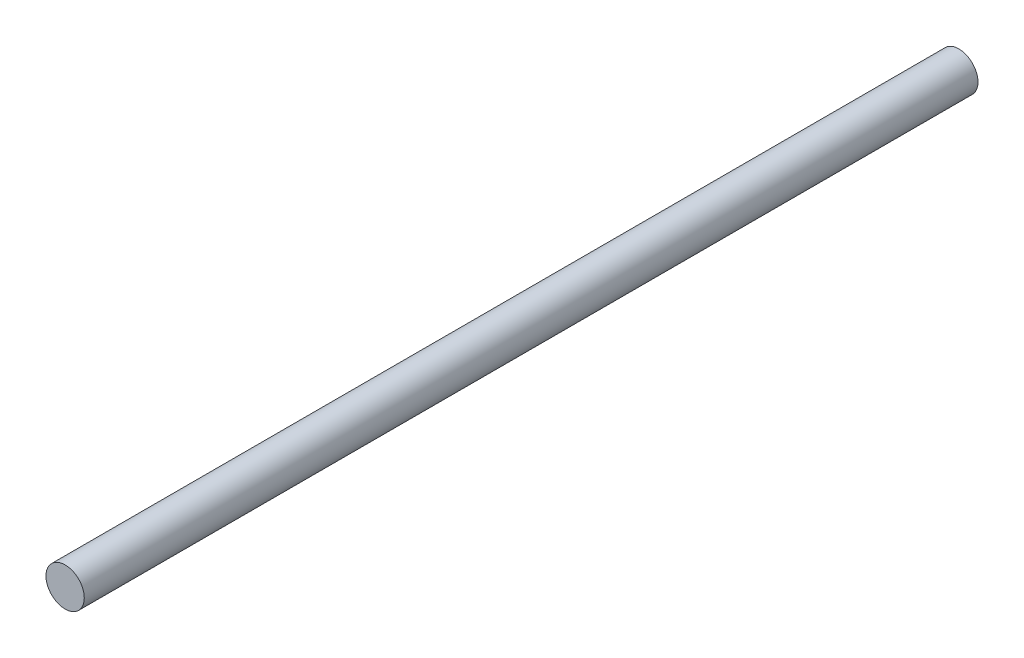
ISO-10303-21;
HEADER;
FILE_DESCRIPTION(('STEP AP214'),'2;1');
FILE_NAME('part.step','',(''),(''),'','','');
FILE_SCHEMA(('AUTOMOTIVE_DESIGN { 1 0 10303 214 1 1 1 1 }'));
ENDSEC;
DATA;
#1=APPLICATION_CONTEXT('core data for automotive mechanical design processes');
#2=APPLICATION_PROTOCOL_DEFINITION('international standard','automotive_design',2000,#1);
#3=PRODUCT_CONTEXT('',#1,'mechanical');
#4=PRODUCT('Part','Part','',(#3));
#5=PRODUCT_RELATED_PRODUCT_CATEGORY('part','',(#4));
#6=PRODUCT_DEFINITION_FORMATION('','',#4);
#7=PRODUCT_DEFINITION_CONTEXT('part definition',#1,'design');
#8=PRODUCT_DEFINITION('design','',#6,#7);
#9=PRODUCT_DEFINITION_SHAPE('','',#8);
#10=(LENGTH_UNIT() NAMED_UNIT(*) SI_UNIT(.MILLI.,.METRE.));
#11=(NAMED_UNIT(*) PLANE_ANGLE_UNIT() SI_UNIT($,.RADIAN.));
#12=(NAMED_UNIT(*) SI_UNIT($,.STERADIAN.) SOLID_ANGLE_UNIT());
#13=UNCERTAINTY_MEASURE_WITH_UNIT(LENGTH_MEASURE(1.E-05),#10,'distance_accuracy_value','');
#14=(GEOMETRIC_REPRESENTATION_CONTEXT(3) GLOBAL_UNCERTAINTY_ASSIGNED_CONTEXT((#13)) GLOBAL_UNIT_ASSIGNED_CONTEXT((#10,
#11,#12)) REPRESENTATION_CONTEXT('',''));
#15=CARTESIAN_POINT('',(0.,0.,0.));
#16=DIRECTION('',(0.,0.,1.));
#17=DIRECTION('',(1.,0.,0.));
#18=AXIS2_PLACEMENT_3D('',#15,#16,#17);
#19=CARTESIAN_POINT('',(0.,0.,70.));
#20=DIRECTION('',(0.,0.,-1.));
#21=DIRECTION('',(-1.,0.,0.));
#22=AXIS2_PLACEMENT_3D('',#19,#20,#21);
#23=CYLINDRICAL_SURFACE('',#22,1.5);
#24=CARTESIAN_POINT('',(0.,0.,70.));
#25=DIRECTION('',(0.,0.,1.));
#26=DIRECTION('',(1.,0.,0.));
#27=AXIS2_PLACEMENT_3D('',#24,#25,#26);
#28=CIRCLE('',#27,1.5);
#29=CARTESIAN_POINT('',(1.5,0.,70.));
#30=VERTEX_POINT('',#29);
#31=EDGE_CURVE('E10',#30,#30,#28,.T.);
#32=ORIENTED_EDGE('',*,*,#31,.F.);
#33=EDGE_LOOP('',(#32));
#34=FACE_BOUND('',#33,.T.);
#35=CARTESIAN_POINT('',(0.,0.,0.));
#36=DIRECTION('',(0.,0.,1.));
#37=DIRECTION('',(1.,0.,0.));
#38=AXIS2_PLACEMENT_3D('',#35,#36,#37);
#39=CIRCLE('',#38,1.5);
#40=CARTESIAN_POINT('',(1.5,0.,0.));
#41=VERTEX_POINT('',#40);
#42=EDGE_CURVE('E36',#41,#41,#39,.T.);
#43=ORIENTED_EDGE('',*,*,#42,.T.);
#44=EDGE_LOOP('',(#43));
#45=FACE_BOUND('',#44,.T.);
#46=ADVANCED_FACE('F33',(#34,#45),#23,.T.);
#47=CARTESIAN_POINT('',(0.,0.,70.));
#48=DIRECTION('',(0.,0.,1.));
#49=DIRECTION('',(1.,0.,0.));
#50=AXIS2_PLACEMENT_3D('',#47,#48,#49);
#51=PLANE('',#50);
#52=ORIENTED_EDGE('',*,*,#31,.T.);
#53=EDGE_LOOP('',(#52));
#54=FACE_BOUND('',#53,.T.);
#55=ADVANCED_FACE('F48',(#54),#51,.T.);
#56=CARTESIAN_POINT('',(0.,0.,0.));
#57=DIRECTION('',(0.,0.,1.));
#58=DIRECTION('',(1.,0.,0.));
#59=AXIS2_PLACEMENT_3D('',#56,#57,#58);
#60=PLANE('',#59);
#61=ORIENTED_EDGE('',*,*,#42,.F.);
#62=EDGE_LOOP('',(#61));
#63=FACE_BOUND('',#62,.T.);
#64=ADVANCED_FACE('F46',(#63),#60,.F.);
#65=CLOSED_SHELL('',(#46,#55,#64));
#66=MANIFOLD_SOLID_BREP('B2',#65);
#67=ADVANCED_BREP_SHAPE_REPRESENTATION('',(#18,#66),#14);
#68=SHAPE_DEFINITION_REPRESENTATION(#9,#67);
ENDSEC;
END-ISO-10303-21;
